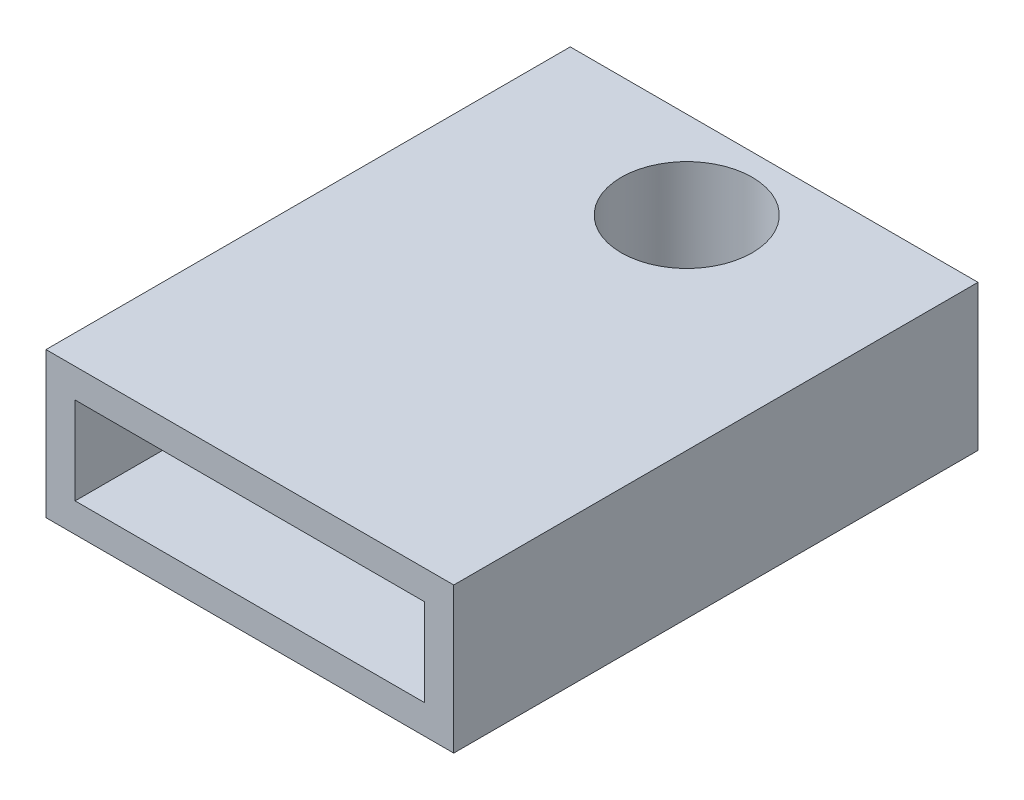
ISO-10303-21;
HEADER;
FILE_DESCRIPTION(('STEP AP214'),'2;1');
FILE_NAME('part.step','',(''),(''),'','','');
FILE_SCHEMA(('AUTOMOTIVE_DESIGN { 1 0 10303 214 1 1 1 1 }'));
ENDSEC;
DATA;
#1=APPLICATION_CONTEXT('core data for automotive mechanical design processes');
#2=APPLICATION_PROTOCOL_DEFINITION('international standard','automotive_design',2000,#1);
#3=PRODUCT_CONTEXT('',#1,'mechanical');
#4=PRODUCT('Part','Part','',(#3));
#5=PRODUCT_RELATED_PRODUCT_CATEGORY('part','',(#4));
#6=PRODUCT_DEFINITION_FORMATION('','',#4);
#7=PRODUCT_DEFINITION_CONTEXT('part definition',#1,'design');
#8=PRODUCT_DEFINITION('design','',#6,#7);
#9=PRODUCT_DEFINITION_SHAPE('','',#8);
#10=(LENGTH_UNIT() NAMED_UNIT(*) SI_UNIT(.MILLI.,.METRE.));
#11=(NAMED_UNIT(*) PLANE_ANGLE_UNIT() SI_UNIT($,.RADIAN.));
#12=(NAMED_UNIT(*) SI_UNIT($,.STERADIAN.) SOLID_ANGLE_UNIT());
#13=UNCERTAINTY_MEASURE_WITH_UNIT(LENGTH_MEASURE(1.E-05),#10,'distance_accuracy_value','');
#14=(GEOMETRIC_REPRESENTATION_CONTEXT(3) GLOBAL_UNCERTAINTY_ASSIGNED_CONTEXT((#13)) GLOBAL_UNIT_ASSIGNED_CONTEXT((#10,
#11,#12)) REPRESENTATION_CONTEXT('',''));
#15=CARTESIAN_POINT('',(0.,0.,0.));
#16=DIRECTION('',(0.,0.,1.));
#17=DIRECTION('',(1.,0.,0.));
#18=AXIS2_PLACEMENT_3D('',#15,#16,#17);
#19=CARTESIAN_POINT('',(-4.04618927702803,1.91176470588236,-18.));
#20=DIRECTION('',(-1.,0.,0.));
#21=DIRECTION('',(0.,0.,1.));
#22=AXIS2_PLACEMENT_3D('',#19,#20,#21);
#23=PLANE('',#22);
#24=DIRECTION('',(0.,-1.,0.));
#25=VECTOR('',#24,1.);
#26=CARTESIAN_POINT('',(-4.04618927702803,1.91176470588236,0.));
#27=LINE('',#26,#25);
#28=CARTESIAN_POINT('',(-4.04618927702803,1.91176470588236,0.));
#29=VERTEX_POINT('',#28);
#30=CARTESIAN_POINT('',(-4.04618927702803,-3.08823529411764,0.));
#31=VERTEX_POINT('',#30);
#32=EDGE_CURVE('E143',#29,#31,#27,.T.);
#33=ORIENTED_EDGE('',*,*,#32,.F.);
#34=DIRECTION('',(0.,0.,1.));
#35=VECTOR('',#34,1.);
#36=CARTESIAN_POINT('',(-4.04618927702803,1.91176470588236,-18.));
#37=LINE('',#36,#35);
#38=CARTESIAN_POINT('',(-4.04618927702803,1.91176470588236,-18.));
#39=VERTEX_POINT('',#38);
#40=EDGE_CURVE('E11',#39,#29,#37,.T.);
#41=ORIENTED_EDGE('',*,*,#40,.F.);
#42=DIRECTION('',(0.,-1.,0.));
#43=VECTOR('',#42,1.);
#44=CARTESIAN_POINT('',(-4.04618927702803,1.91176470588236,-18.));
#45=LINE('',#44,#43);
#46=CARTESIAN_POINT('',(-4.04618927702803,-3.08823529411764,-18.));
#47=VERTEX_POINT('',#46);
#48=EDGE_CURVE('E147',#39,#47,#45,.T.);
#49=ORIENTED_EDGE('',*,*,#48,.T.);
#50=DIRECTION('',(0.,0.,1.));
#51=VECTOR('',#50,1.);
#52=CARTESIAN_POINT('',(-4.04618927702803,-3.08823529411764,-18.));
#53=LINE('',#52,#51);
#54=EDGE_CURVE('E36',#47,#31,#53,.T.);
#55=ORIENTED_EDGE('',*,*,#54,.T.);
#56=EDGE_LOOP('',(#33,#41,#49,#55));
#57=FACE_BOUND('',#56,.T.);
#58=ADVANCED_FACE('F33',(#57),#23,.T.);
#59=CARTESIAN_POINT('',(-4.04618927702803,1.91176470588236,-18.));
#60=DIRECTION('',(0.,1.,0.));
#61=DIRECTION('',(0.,0.,1.));
#62=AXIS2_PLACEMENT_3D('',#59,#60,#61);
#63=PLANE('',#62);
#64=CARTESIAN_POINT('',(2.95381072297197,1.91176470588236,-15.));
#65=DIRECTION('',(0.,1.,0.));
#66=DIRECTION('',(0.,0.,1.));
#67=AXIS2_PLACEMENT_3D('',#64,#65,#66);
#68=CIRCLE('',#67,2.24789999999999);
#69=CARTESIAN_POINT('',(2.95381072297197,1.91176470588236,-12.7521));
#70=VERTEX_POINT('',#69);
#71=EDGE_CURVE('E131',#70,#70,#68,.T.);
#72=ORIENTED_EDGE('',*,*,#71,.F.);
#73=EDGE_LOOP('',(#72));
#74=FACE_BOUND('',#73,.T.);
#75=DIRECTION('',(-1.,0.,0.));
#76=VECTOR('',#75,1.);
#77=CARTESIAN_POINT('',(-4.04618927702803,1.91176470588236,0.));
#78=LINE('',#77,#76);
#79=CARTESIAN_POINT('',(9.95381072297197,1.91176470588236,0.));
#80=VERTEX_POINT('',#79);
#81=EDGE_CURVE('E150',#80,#29,#78,.T.);
#82=ORIENTED_EDGE('',*,*,#81,.F.);
#83=DIRECTION('',(0.,0.,1.));
#84=VECTOR('',#83,1.);
#85=CARTESIAN_POINT('',(9.95381072297197,1.91176470588236,-18.));
#86=LINE('',#85,#84);
#87=CARTESIAN_POINT('',(9.95381072297197,1.91176470588236,-18.));
#88=VERTEX_POINT('',#87);
#89=EDGE_CURVE('E41',#88,#80,#86,.T.);
#90=ORIENTED_EDGE('',*,*,#89,.F.);
#91=DIRECTION('',(-1.,0.,0.));
#92=VECTOR('',#91,1.);
#93=CARTESIAN_POINT('',(-4.04618927702803,1.91176470588236,-18.));
#94=LINE('',#93,#92);
#95=EDGE_CURVE('E155',#88,#39,#94,.T.);
#96=ORIENTED_EDGE('',*,*,#95,.T.);
#97=ORIENTED_EDGE('',*,*,#40,.T.);
#98=EDGE_LOOP('',(#82,#90,#96,#97));
#99=FACE_BOUND('',#98,.T.);
#100=ADVANCED_FACE('F172',(#74,#99),#63,.T.);
#101=CARTESIAN_POINT('',(9.95381072297197,1.91176470588236,-18.));
#102=DIRECTION('',(1.,0.,0.));
#103=DIRECTION('',(0.,0.,-1.));
#104=AXIS2_PLACEMENT_3D('',#101,#102,#103);
#105=PLANE('',#104);
#106=DIRECTION('',(0.,1.,0.));
#107=VECTOR('',#106,1.);
#108=CARTESIAN_POINT('',(9.95381072297197,1.91176470588236,0.));
#109=LINE('',#108,#107);
#110=CARTESIAN_POINT('',(9.95381072297197,-3.08823529411764,0.));
#111=VERTEX_POINT('',#110);
#112=EDGE_CURVE('E162',#111,#80,#109,.T.);
#113=ORIENTED_EDGE('',*,*,#112,.F.);
#114=DIRECTION('',(0.,0.,1.));
#115=VECTOR('',#114,1.);
#116=CARTESIAN_POINT('',(9.95381072297197,-3.08823529411764,-18.));
#117=LINE('',#116,#115);
#118=CARTESIAN_POINT('',(9.95381072297197,-3.08823529411764,-18.));
#119=VERTEX_POINT('',#118);
#120=EDGE_CURVE('E167',#119,#111,#117,.T.);
#121=ORIENTED_EDGE('',*,*,#120,.F.);
#122=DIRECTION('',(0.,1.,0.));
#123=VECTOR('',#122,1.);
#124=CARTESIAN_POINT('',(9.95381072297197,1.91176470588236,-18.));
#125=LINE('',#124,#123);
#126=EDGE_CURVE('E152',#119,#88,#125,.T.);
#127=ORIENTED_EDGE('',*,*,#126,.T.);
#128=ORIENTED_EDGE('',*,*,#89,.T.);
#129=EDGE_LOOP('',(#113,#121,#127,#128));
#130=FACE_BOUND('',#129,.T.);
#131=ADVANCED_FACE('F176',(#130),#105,.T.);
#132=CARTESIAN_POINT('',(-4.04618927702803,-3.08823529411764,-18.));
#133=DIRECTION('',(0.,-1.,0.));
#134=DIRECTION('',(0.,0.,-1.));
#135=AXIS2_PLACEMENT_3D('',#132,#133,#134);
#136=PLANE('',#135);
#137=CARTESIAN_POINT('',(2.95381072297197,-3.08823529411765,-15.));
#138=DIRECTION('',(0.,-1.,0.));
#139=DIRECTION('',(0.,0.,-1.));
#140=AXIS2_PLACEMENT_3D('',#137,#138,#139);
#141=CIRCLE('',#140,2.24789999999999);
#142=CARTESIAN_POINT('',(2.95381072297197,-3.08823529411765,-17.2479));
#143=VERTEX_POINT('',#142);
#144=EDGE_CURVE('E202',#143,#143,#141,.T.);
#145=ORIENTED_EDGE('',*,*,#144,.F.);
#146=EDGE_LOOP('',(#145));
#147=FACE_BOUND('',#146,.T.);
#148=DIRECTION('',(1.,0.,0.));
#149=VECTOR('',#148,1.);
#150=CARTESIAN_POINT('',(-4.04618927702803,-3.08823529411764,0.));
#151=LINE('',#150,#149);
#152=EDGE_CURVE('E159',#31,#111,#151,.T.);
#153=ORIENTED_EDGE('',*,*,#152,.F.);
#154=ORIENTED_EDGE('',*,*,#54,.F.);
#155=DIRECTION('',(1.,0.,0.));
#156=VECTOR('',#155,1.);
#157=CARTESIAN_POINT('',(-4.04618927702803,-3.08823529411764,-18.));
#158=LINE('',#157,#156);
#159=EDGE_CURVE('E149',#47,#119,#158,.T.);
#160=ORIENTED_EDGE('',*,*,#159,.T.);
#161=ORIENTED_EDGE('',*,*,#120,.T.);
#162=EDGE_LOOP('',(#153,#154,#160,#161));
#163=FACE_BOUND('',#162,.T.);
#164=ADVANCED_FACE('F169',(#147,#163),#136,.T.);
#165=CARTESIAN_POINT('',(0.,0.,-18.));
#166=DIRECTION('',(0.,0.,1.));
#167=DIRECTION('',(1.,0.,0.));
#168=AXIS2_PLACEMENT_3D('',#165,#166,#167);
#169=PLANE('',#168);
#170=ORIENTED_EDGE('',*,*,#48,.F.);
#171=ORIENTED_EDGE('',*,*,#95,.F.);
#172=ORIENTED_EDGE('',*,*,#126,.F.);
#173=ORIENTED_EDGE('',*,*,#159,.F.);
#174=EDGE_LOOP('',(#170,#171,#172,#173));
#175=FACE_BOUND('',#174,.T.);
#176=ADVANCED_FACE('F178',(#175),#169,.F.);
#177=CARTESIAN_POINT('',(0.,0.,0.));
#178=DIRECTION('',(0.,0.,1.));
#179=DIRECTION('',(1.,0.,0.));
#180=AXIS2_PLACEMENT_3D('',#177,#178,#179);
#181=PLANE('',#180);
#182=DIRECTION('',(0.,-1.,0.));
#183=VECTOR('',#182,1.);
#184=CARTESIAN_POINT('',(-3.04618927702803,0.911764705882355,0.));
#185=LINE('',#184,#183);
#186=CARTESIAN_POINT('',(-3.04618927702803,0.911764705882355,0.));
#187=VERTEX_POINT('',#186);
#188=CARTESIAN_POINT('',(-3.04618927702803,-2.08823529411764,0.));
#189=VERTEX_POINT('',#188);
#190=EDGE_CURVE('E49',#187,#189,#185,.T.);
#191=ORIENTED_EDGE('',*,*,#190,.F.);
#192=DIRECTION('',(-1.,0.,0.));
#193=VECTOR('',#192,1.);
#194=CARTESIAN_POINT('',(-3.04618927702803,0.911764705882355,0.));
#195=LINE('',#194,#193);
#196=CARTESIAN_POINT('',(8.95381072297197,0.911764705882355,0.));
#197=VERTEX_POINT('',#196);
#198=EDGE_CURVE('E125',#197,#187,#195,.T.);
#199=ORIENTED_EDGE('',*,*,#198,.F.);
#200=DIRECTION('',(0.,1.,0.));
#201=VECTOR('',#200,1.);
#202=CARTESIAN_POINT('',(8.95381072297197,0.911764705882355,0.));
#203=LINE('',#202,#201);
#204=CARTESIAN_POINT('',(8.95381072297197,-2.08823529411764,0.));
#205=VERTEX_POINT('',#204);
#206=EDGE_CURVE('E128',#205,#197,#203,.T.);
#207=ORIENTED_EDGE('',*,*,#206,.F.);
#208=DIRECTION('',(1.,0.,0.));
#209=VECTOR('',#208,1.);
#210=CARTESIAN_POINT('',(-3.04618927702803,-2.08823529411764,0.));
#211=LINE('',#210,#209);
#212=EDGE_CURVE('E137',#189,#205,#211,.T.);
#213=ORIENTED_EDGE('',*,*,#212,.F.);
#214=EDGE_LOOP('',(#191,#199,#207,#213));
#215=FACE_BOUND('',#214,.T.);
#216=ORIENTED_EDGE('',*,*,#32,.T.);
#217=ORIENTED_EDGE('',*,*,#152,.T.);
#218=ORIENTED_EDGE('',*,*,#112,.T.);
#219=ORIENTED_EDGE('',*,*,#81,.T.);
#220=EDGE_LOOP('',(#216,#217,#218,#219));
#221=FACE_BOUND('',#220,.T.);
#222=ADVANCED_FACE('F171',(#215,#221),#181,.T.);
#223=CARTESIAN_POINT('',(-3.04618927702803,0.911764705882355,-8.));
#224=DIRECTION('',(-1.,0.,0.));
#225=DIRECTION('',(0.,-1.,0.));
#226=AXIS2_PLACEMENT_3D('',#223,#224,#225);
#227=PLANE('',#226);
#228=ORIENTED_EDGE('',*,*,#190,.T.);
#229=DIRECTION('',(0.,0.,1.));
#230=VECTOR('',#229,1.);
#231=CARTESIAN_POINT('',(-3.04618927702803,-2.08823529411764,-8.));
#232=LINE('',#231,#230);
#233=CARTESIAN_POINT('',(-3.04618927702803,-2.08823529411764,-8.));
#234=VERTEX_POINT('',#233);
#235=EDGE_CURVE('E103',#234,#189,#232,.T.);
#236=ORIENTED_EDGE('',*,*,#235,.F.);
#237=DIRECTION('',(0.,-1.,0.));
#238=VECTOR('',#237,1.);
#239=CARTESIAN_POINT('',(-3.04618927702803,0.911764705882355,-8.));
#240=LINE('',#239,#238);
#241=CARTESIAN_POINT('',(-3.04618927702803,0.911764705882355,-8.));
#242=VERTEX_POINT('',#241);
#243=EDGE_CURVE('E107',#242,#234,#240,.T.);
#244=ORIENTED_EDGE('',*,*,#243,.F.);
#245=DIRECTION('',(0.,0.,1.));
#246=VECTOR('',#245,1.);
#247=CARTESIAN_POINT('',(-3.04618927702803,0.911764705882355,-8.));
#248=LINE('',#247,#246);
#249=EDGE_CURVE('E141',#242,#187,#248,.T.);
#250=ORIENTED_EDGE('',*,*,#249,.T.);
#251=EDGE_LOOP('',(#228,#236,#244,#250));
#252=FACE_BOUND('',#251,.T.);
#253=ADVANCED_FACE('F105',(#252),#227,.F.);
#254=CARTESIAN_POINT('',(-3.04618927702803,0.911764705882355,-8.));
#255=DIRECTION('',(0.,1.,0.));
#256=DIRECTION('',(0.,0.,1.));
#257=AXIS2_PLACEMENT_3D('',#254,#255,#256);
#258=PLANE('',#257);
#259=ORIENTED_EDGE('',*,*,#198,.T.);
#260=ORIENTED_EDGE('',*,*,#249,.F.);
#261=DIRECTION('',(-1.,0.,0.));
#262=VECTOR('',#261,1.);
#263=CARTESIAN_POINT('',(-3.04618927702803,0.911764705882355,-8.));
#264=LINE('',#263,#262);
#265=CARTESIAN_POINT('',(8.95381072297197,0.911764705882355,-8.));
#266=VERTEX_POINT('',#265);
#267=EDGE_CURVE('E113',#266,#242,#264,.T.);
#268=ORIENTED_EDGE('',*,*,#267,.F.);
#269=DIRECTION('',(0.,0.,1.));
#270=VECTOR('',#269,1.);
#271=CARTESIAN_POINT('',(8.95381072297197,0.911764705882355,-8.));
#272=LINE('',#271,#270);
#273=EDGE_CURVE('E144',#266,#197,#272,.T.);
#274=ORIENTED_EDGE('',*,*,#273,.T.);
#275=EDGE_LOOP('',(#259,#260,#268,#274));
#276=FACE_BOUND('',#275,.T.);
#277=ADVANCED_FACE('F214',(#276),#258,.F.);
#278=CARTESIAN_POINT('',(8.95381072297197,0.911764705882355,-8.));
#279=DIRECTION('',(1.,0.,0.));
#280=DIRECTION('',(0.,0.,-1.));
#281=AXIS2_PLACEMENT_3D('',#278,#279,#280);
#282=PLANE('',#281);
#283=ORIENTED_EDGE('',*,*,#206,.T.);
#284=ORIENTED_EDGE('',*,*,#273,.F.);
#285=DIRECTION('',(0.,1.,0.));
#286=VECTOR('',#285,1.);
#287=CARTESIAN_POINT('',(8.95381072297197,0.911764705882355,-8.));
#288=LINE('',#287,#286);
#289=CARTESIAN_POINT('',(8.95381072297197,-2.08823529411764,-8.));
#290=VERTEX_POINT('',#289);
#291=EDGE_CURVE('E121',#290,#266,#288,.T.);
#292=ORIENTED_EDGE('',*,*,#291,.F.);
#293=DIRECTION('',(0.,0.,1.));
#294=VECTOR('',#293,1.);
#295=CARTESIAN_POINT('',(8.95381072297197,-2.08823529411764,-8.));
#296=LINE('',#295,#294);
#297=EDGE_CURVE('E112',#290,#205,#296,.T.);
#298=ORIENTED_EDGE('',*,*,#297,.T.);
#299=EDGE_LOOP('',(#283,#284,#292,#298));
#300=FACE_BOUND('',#299,.T.);
#301=ADVANCED_FACE('F217',(#300),#282,.F.);
#302=CARTESIAN_POINT('',(-3.04618927702803,-2.08823529411764,-8.));
#303=DIRECTION('',(0.,-1.,0.));
#304=DIRECTION('',(0.,0.,-1.));
#305=AXIS2_PLACEMENT_3D('',#302,#303,#304);
#306=PLANE('',#305);
#307=ORIENTED_EDGE('',*,*,#212,.T.);
#308=ORIENTED_EDGE('',*,*,#297,.F.);
#309=DIRECTION('',(1.,0.,0.));
#310=VECTOR('',#309,1.);
#311=CARTESIAN_POINT('',(-3.04618927702803,-2.08823529411764,-8.));
#312=LINE('',#311,#310);
#313=EDGE_CURVE('E116',#234,#290,#312,.T.);
#314=ORIENTED_EDGE('',*,*,#313,.F.);
#315=ORIENTED_EDGE('',*,*,#235,.T.);
#316=EDGE_LOOP('',(#307,#308,#314,#315));
#317=FACE_BOUND('',#316,.T.);
#318=ADVANCED_FACE('F117',(#317),#306,.F.);
#319=CARTESIAN_POINT('',(0.,0.,-8.));
#320=DIRECTION('',(0.,0.,1.));
#321=DIRECTION('',(1.,0.,0.));
#322=AXIS2_PLACEMENT_3D('',#319,#320,#321);
#323=PLANE('',#322);
#324=ORIENTED_EDGE('',*,*,#243,.T.);
#325=ORIENTED_EDGE('',*,*,#313,.T.);
#326=ORIENTED_EDGE('',*,*,#291,.T.);
#327=ORIENTED_EDGE('',*,*,#267,.T.);
#328=EDGE_LOOP('',(#324,#325,#326,#327));
#329=FACE_BOUND('',#328,.T.);
#330=ADVANCED_FACE('F123',(#329),#323,.T.);
#331=CARTESIAN_POINT('',(2.95381072297197,-3.08823529411764,-15.));
#332=DIRECTION('',(0.,-1.,0.));
#333=DIRECTION('',(0.,0.,-1.));
#334=AXIS2_PLACEMENT_3D('',#331,#332,#333);
#335=CYLINDRICAL_SURFACE('',#334,2.24789999999999);
#336=ORIENTED_EDGE('',*,*,#71,.T.);
#337=EDGE_LOOP('',(#336));
#338=FACE_BOUND('',#337,.T.);
#339=ORIENTED_EDGE('',*,*,#144,.T.);
#340=EDGE_LOOP('',(#339));
#341=FACE_BOUND('',#340,.T.);
#342=ADVANCED_FACE('F206',(#338,#341),#335,.F.);
#343=CLOSED_SHELL('',(#58,#100,#131,#164,#176,#222,#253,#277,#301,#318,#330,#342));
#344=MANIFOLD_SOLID_BREP('B2',#343);
#345=ADVANCED_BREP_SHAPE_REPRESENTATION('',(#18,#344),#14);
#346=SHAPE_DEFINITION_REPRESENTATION(#9,#345);
ENDSEC;
END-ISO-10303-21;
